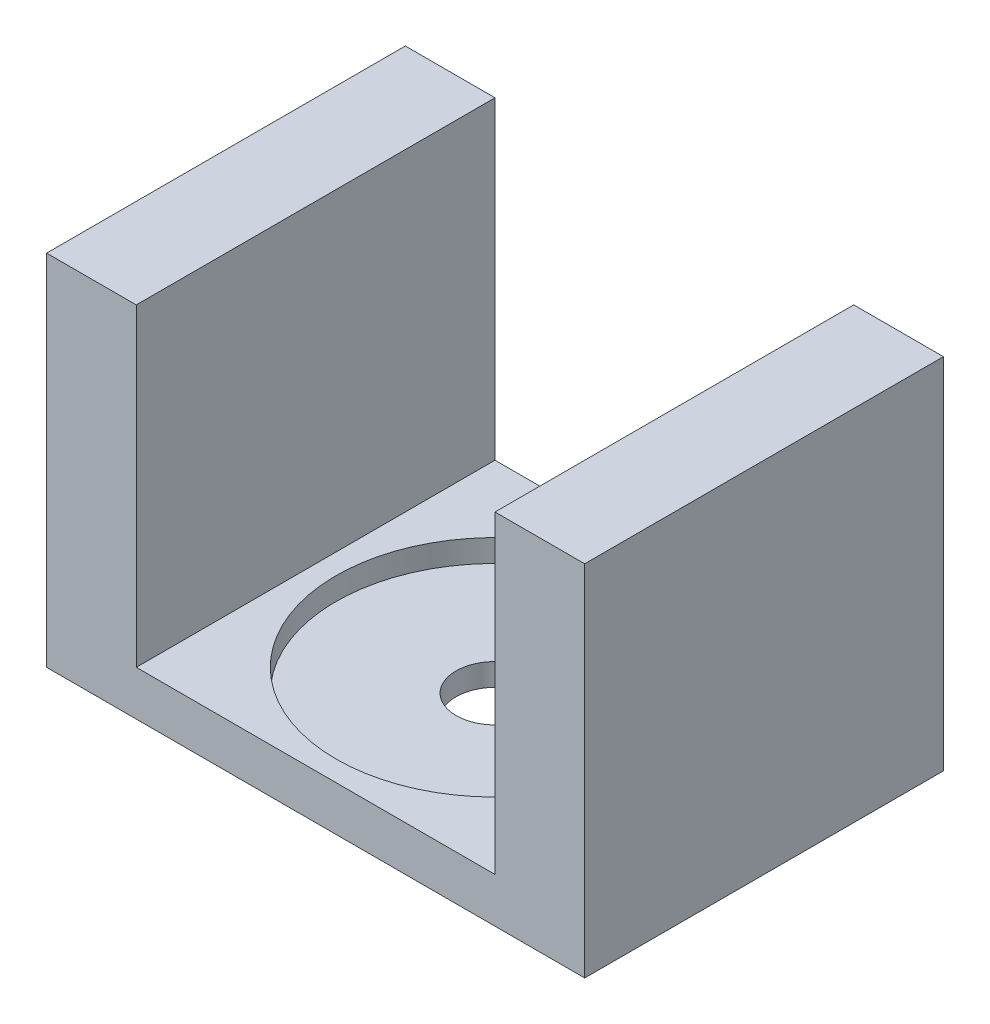
ISO-10303-21;
HEADER;
FILE_DESCRIPTION(('STEP AP214'),'2;1');
FILE_NAME('part.step','',(''),(''),'','','');
FILE_SCHEMA(('AUTOMOTIVE_DESIGN { 1 0 10303 214 1 1 1 1 }'));
ENDSEC;
DATA;
#1=APPLICATION_CONTEXT('core data for automotive mechanical design processes');
#2=APPLICATION_PROTOCOL_DEFINITION('international standard','automotive_design',2000,#1);
#3=PRODUCT_CONTEXT('',#1,'mechanical');
#4=PRODUCT('Part','Part','',(#3));
#5=PRODUCT_RELATED_PRODUCT_CATEGORY('part','',(#4));
#6=PRODUCT_DEFINITION_FORMATION('','',#4);
#7=PRODUCT_DEFINITION_CONTEXT('part definition',#1,'design');
#8=PRODUCT_DEFINITION('design','',#6,#7);
#9=PRODUCT_DEFINITION_SHAPE('','',#8);
#10=(LENGTH_UNIT() NAMED_UNIT(*) SI_UNIT(.MILLI.,.METRE.));
#11=(NAMED_UNIT(*) PLANE_ANGLE_UNIT() SI_UNIT($,.RADIAN.));
#12=(NAMED_UNIT(*) SI_UNIT($,.STERADIAN.) SOLID_ANGLE_UNIT());
#13=UNCERTAINTY_MEASURE_WITH_UNIT(LENGTH_MEASURE(1.E-05),#10,'distance_accuracy_value','');
#14=(GEOMETRIC_REPRESENTATION_CONTEXT(3) GLOBAL_UNCERTAINTY_ASSIGNED_CONTEXT((#13)) GLOBAL_UNIT_ASSIGNED_CONTEXT((#10,
#11,#12)) REPRESENTATION_CONTEXT('',''));
#15=CARTESIAN_POINT('',(0.,0.,0.));
#16=DIRECTION('',(0.,0.,1.));
#17=DIRECTION('',(1.,0.,0.));
#18=AXIS2_PLACEMENT_3D('',#15,#16,#17);
#19=CARTESIAN_POINT('',(-25.4,6.34999999999997,50.8));
#20=DIRECTION('',(-1.,0.,0.));
#21=DIRECTION('',(0.,-1.,0.));
#22=AXIS2_PLACEMENT_3D('',#19,#20,#21);
#23=PLANE('',#22);
#24=DIRECTION('',(0.,1.,0.));
#25=VECTOR('',#24,1.);
#26=CARTESIAN_POINT('',(-25.4,6.34999999999997,0.));
#27=LINE('',#26,#25);
#28=CARTESIAN_POINT('',(-25.4,6.34999999999997,0.));
#29=VERTEX_POINT('',#28);
#30=CARTESIAN_POINT('',(-25.4,50.8,0.));
#31=VERTEX_POINT('',#30);
#32=EDGE_CURVE('E128',#29,#31,#27,.T.);
#33=ORIENTED_EDGE('',*,*,#32,.T.);
#34=DIRECTION('',(0.,0.,-1.));
#35=VECTOR('',#34,1.);
#36=CARTESIAN_POINT('',(-25.4,50.8,50.8));
#37=LINE('',#36,#35);
#38=CARTESIAN_POINT('',(-25.4,50.8,50.8));
#39=VERTEX_POINT('',#38);
#40=EDGE_CURVE('E11',#39,#31,#37,.T.);
#41=ORIENTED_EDGE('',*,*,#40,.F.);
#42=DIRECTION('',(0.,1.,0.));
#43=VECTOR('',#42,1.);
#44=CARTESIAN_POINT('',(-25.4,6.34999999999997,50.8));
#45=LINE('',#44,#43);
#46=CARTESIAN_POINT('',(-25.4,6.34999999999997,50.8));
#47=VERTEX_POINT('',#46);
#48=EDGE_CURVE('E143',#47,#39,#45,.T.);
#49=ORIENTED_EDGE('',*,*,#48,.F.);
#50=DIRECTION('',(0.,0.,-1.));
#51=VECTOR('',#50,1.);
#52=CARTESIAN_POINT('',(-25.4,6.34999999999997,50.8));
#53=LINE('',#52,#51);
#54=EDGE_CURVE('E124',#47,#29,#53,.T.);
#55=ORIENTED_EDGE('',*,*,#54,.T.);
#56=EDGE_LOOP('',(#33,#41,#49,#55));
#57=FACE_BOUND('',#56,.T.);
#58=ADVANCED_FACE('F32',(#57),#23,.F.);
#59=CARTESIAN_POINT('',(-25.4,50.8,50.8));
#60=DIRECTION('',(0.,-1.,0.));
#61=DIRECTION('',(0.,0.,-1.));
#62=AXIS2_PLACEMENT_3D('',#59,#60,#61);
#63=PLANE('',#62);
#64=DIRECTION('',(-1.,0.,0.));
#65=VECTOR('',#64,1.);
#66=CARTESIAN_POINT('',(-25.4,50.8,0.));
#67=LINE('',#66,#65);
#68=CARTESIAN_POINT('',(-38.1,50.8,0.));
#69=VERTEX_POINT('',#68);
#70=EDGE_CURVE('E131',#31,#69,#67,.T.);
#71=ORIENTED_EDGE('',*,*,#70,.T.);
#72=DIRECTION('',(0.,0.,-1.));
#73=VECTOR('',#72,1.);
#74=CARTESIAN_POINT('',(-38.1,50.8,50.8));
#75=LINE('',#74,#73);
#76=CARTESIAN_POINT('',(-38.1,50.8,50.8));
#77=VERTEX_POINT('',#76);
#78=EDGE_CURVE('E40',#77,#69,#75,.T.);
#79=ORIENTED_EDGE('',*,*,#78,.F.);
#80=DIRECTION('',(-1.,0.,0.));
#81=VECTOR('',#80,1.);
#82=CARTESIAN_POINT('',(-25.4,50.8,50.8));
#83=LINE('',#82,#81);
#84=EDGE_CURVE('E91',#39,#77,#83,.T.);
#85=ORIENTED_EDGE('',*,*,#84,.F.);
#86=ORIENTED_EDGE('',*,*,#40,.T.);
#87=EDGE_LOOP('',(#71,#79,#85,#86));
#88=FACE_BOUND('',#87,.T.);
#89=ADVANCED_FACE('F218',(#88),#63,.F.);
#90=CARTESIAN_POINT('',(-38.1,0.,50.8));
#91=DIRECTION('',(1.,0.,0.));
#92=DIRECTION('',(0.,0.,-1.));
#93=AXIS2_PLACEMENT_3D('',#90,#91,#92);
#94=PLANE('',#93);
#95=DIRECTION('',(0.,-1.,0.));
#96=VECTOR('',#95,1.);
#97=CARTESIAN_POINT('',(-38.1,0.,0.));
#98=LINE('',#97,#96);
#99=CARTESIAN_POINT('',(-38.1,0.,0.));
#100=VERTEX_POINT('',#99);
#101=EDGE_CURVE('E134',#69,#100,#98,.T.);
#102=ORIENTED_EDGE('',*,*,#101,.T.);
#103=DIRECTION('',(0.,0.,-1.));
#104=VECTOR('',#103,1.);
#105=CARTESIAN_POINT('',(-38.1,0.,50.8));
#106=LINE('',#105,#104);
#107=CARTESIAN_POINT('',(-38.1,0.,50.8));
#108=VERTEX_POINT('',#107);
#109=EDGE_CURVE('E150',#108,#100,#106,.T.);
#110=ORIENTED_EDGE('',*,*,#109,.F.);
#111=DIRECTION('',(0.,-1.,0.));
#112=VECTOR('',#111,1.);
#113=CARTESIAN_POINT('',(-38.1,0.,50.8));
#114=LINE('',#113,#112);
#115=EDGE_CURVE('E158',#77,#108,#114,.T.);
#116=ORIENTED_EDGE('',*,*,#115,.F.);
#117=ORIENTED_EDGE('',*,*,#78,.T.);
#118=EDGE_LOOP('',(#102,#110,#116,#117));
#119=FACE_BOUND('',#118,.T.);
#120=ADVANCED_FACE('F156',(#119),#94,.F.);
#121=CARTESIAN_POINT('',(38.1,0.,50.8));
#122=DIRECTION('',(0.,1.,0.));
#123=DIRECTION('',(0.,0.,1.));
#124=AXIS2_PLACEMENT_3D('',#121,#122,#123);
#125=PLANE('',#124);
#126=CARTESIAN_POINT('',(0.,0.,25.4));
#127=DIRECTION('',(0.,1.,0.));
#128=DIRECTION('',(0.,0.,1.));
#129=AXIS2_PLACEMENT_3D('',#126,#127,#128);
#130=CIRCLE('',#129,5.5);
#131=CARTESIAN_POINT('',(0.,0.,30.9));
#132=VERTEX_POINT('',#131);
#133=EDGE_CURVE('E179',#132,#132,#130,.T.);
#134=ORIENTED_EDGE('',*,*,#133,.T.);
#135=EDGE_LOOP('',(#134));
#136=FACE_BOUND('',#135,.T.);
#137=DIRECTION('',(1.,0.,0.));
#138=VECTOR('',#137,1.);
#139=CARTESIAN_POINT('',(38.1,0.,0.));
#140=LINE('',#139,#138);
#141=CARTESIAN_POINT('',(38.1,0.,0.));
#142=VERTEX_POINT('',#141);
#143=EDGE_CURVE('E136',#100,#142,#140,.T.);
#144=ORIENTED_EDGE('',*,*,#143,.T.);
#145=DIRECTION('',(0.,0.,-1.));
#146=VECTOR('',#145,1.);
#147=CARTESIAN_POINT('',(38.1,0.,50.8));
#148=LINE('',#147,#146);
#149=CARTESIAN_POINT('',(38.1,0.,50.8));
#150=VERTEX_POINT('',#149);
#151=EDGE_CURVE('E147',#150,#142,#148,.T.);
#152=ORIENTED_EDGE('',*,*,#151,.F.);
#153=DIRECTION('',(1.,0.,0.));
#154=VECTOR('',#153,1.);
#155=CARTESIAN_POINT('',(38.1,0.,50.8));
#156=LINE('',#155,#154);
#157=EDGE_CURVE('E170',#108,#150,#156,.T.);
#158=ORIENTED_EDGE('',*,*,#157,.F.);
#159=ORIENTED_EDGE('',*,*,#109,.T.);
#160=EDGE_LOOP('',(#144,#152,#158,#159));
#161=FACE_BOUND('',#160,.T.);
#162=ADVANCED_FACE('F166',(#136,#161),#125,.F.);
#163=CARTESIAN_POINT('',(38.1,0.,50.8));
#164=DIRECTION('',(-1.,0.,0.));
#165=DIRECTION('',(0.,0.,1.));
#166=AXIS2_PLACEMENT_3D('',#163,#164,#165);
#167=PLANE('',#166);
#168=DIRECTION('',(0.,1.,0.));
#169=VECTOR('',#168,1.);
#170=CARTESIAN_POINT('',(38.1,0.,0.));
#171=LINE('',#170,#169);
#172=CARTESIAN_POINT('',(38.1,50.8,0.));
#173=VERTEX_POINT('',#172);
#174=EDGE_CURVE('E138',#142,#173,#171,.T.);
#175=ORIENTED_EDGE('',*,*,#174,.T.);
#176=DIRECTION('',(0.,0.,-1.));
#177=VECTOR('',#176,1.);
#178=CARTESIAN_POINT('',(38.1,50.8,50.8));
#179=LINE('',#178,#177);
#180=CARTESIAN_POINT('',(38.1,50.8,50.8));
#181=VERTEX_POINT('',#180);
#182=EDGE_CURVE('E119',#181,#173,#179,.T.);
#183=ORIENTED_EDGE('',*,*,#182,.F.);
#184=DIRECTION('',(0.,1.,0.));
#185=VECTOR('',#184,1.);
#186=CARTESIAN_POINT('',(38.1,0.,50.8));
#187=LINE('',#186,#185);
#188=EDGE_CURVE('E110',#150,#181,#187,.T.);
#189=ORIENTED_EDGE('',*,*,#188,.F.);
#190=ORIENTED_EDGE('',*,*,#151,.T.);
#191=EDGE_LOOP('',(#175,#183,#189,#190));
#192=FACE_BOUND('',#191,.T.);
#193=ADVANCED_FACE('F169',(#192),#167,.F.);
#194=CARTESIAN_POINT('',(25.4,50.8,50.8));
#195=DIRECTION('',(0.,-1.,0.));
#196=DIRECTION('',(0.,0.,-1.));
#197=AXIS2_PLACEMENT_3D('',#194,#195,#196);
#198=PLANE('',#197);
#199=DIRECTION('',(-1.,0.,0.));
#200=VECTOR('',#199,1.);
#201=CARTESIAN_POINT('',(25.4,50.8,0.));
#202=LINE('',#201,#200);
#203=CARTESIAN_POINT('',(25.4,50.8,0.));
#204=VERTEX_POINT('',#203);
#205=EDGE_CURVE('E118',#173,#204,#202,.T.);
#206=ORIENTED_EDGE('',*,*,#205,.T.);
#207=DIRECTION('',(0.,0.,-1.));
#208=VECTOR('',#207,1.);
#209=CARTESIAN_POINT('',(25.4,50.8,50.8));
#210=LINE('',#209,#208);
#211=CARTESIAN_POINT('',(25.4,50.8,50.8));
#212=VERTEX_POINT('',#211);
#213=EDGE_CURVE('E115',#212,#204,#210,.T.);
#214=ORIENTED_EDGE('',*,*,#213,.F.);
#215=DIRECTION('',(-1.,0.,0.));
#216=VECTOR('',#215,1.);
#217=CARTESIAN_POINT('',(25.4,50.8,50.8));
#218=LINE('',#217,#216);
#219=EDGE_CURVE('E104',#181,#212,#218,.T.);
#220=ORIENTED_EDGE('',*,*,#219,.F.);
#221=ORIENTED_EDGE('',*,*,#182,.T.);
#222=EDGE_LOOP('',(#206,#214,#220,#221));
#223=FACE_BOUND('',#222,.T.);
#224=ADVANCED_FACE('F116',(#223),#198,.F.);
#225=CARTESIAN_POINT('',(25.4,6.34999999999997,50.8));
#226=DIRECTION('',(1.,0.,0.));
#227=DIRECTION('',(0.,1.,0.));
#228=AXIS2_PLACEMENT_3D('',#225,#226,#227);
#229=PLANE('',#228);
#230=DIRECTION('',(0.,-1.,0.));
#231=VECTOR('',#230,1.);
#232=CARTESIAN_POINT('',(25.4,6.34999999999997,0.));
#233=LINE('',#232,#231);
#234=CARTESIAN_POINT('',(25.4,6.34999999999997,0.));
#235=VERTEX_POINT('',#234);
#236=EDGE_CURVE('E77',#204,#235,#233,.T.);
#237=ORIENTED_EDGE('',*,*,#236,.T.);
#238=DIRECTION('',(0.,0.,-1.));
#239=VECTOR('',#238,1.);
#240=CARTESIAN_POINT('',(25.4,6.34999999999997,50.8));
#241=LINE('',#240,#239);
#242=CARTESIAN_POINT('',(25.4,6.34999999999997,50.8));
#243=VERTEX_POINT('',#242);
#244=EDGE_CURVE('E120',#243,#235,#241,.T.);
#245=ORIENTED_EDGE('',*,*,#244,.F.);
#246=DIRECTION('',(0.,-1.,0.));
#247=VECTOR('',#246,1.);
#248=CARTESIAN_POINT('',(25.4,6.34999999999997,50.8));
#249=LINE('',#248,#247);
#250=EDGE_CURVE('E108',#212,#243,#249,.T.);
#251=ORIENTED_EDGE('',*,*,#250,.F.);
#252=ORIENTED_EDGE('',*,*,#213,.T.);
#253=EDGE_LOOP('',(#237,#245,#251,#252));
#254=FACE_BOUND('',#253,.T.);
#255=ADVANCED_FACE('F122',(#254),#229,.F.);
#256=CARTESIAN_POINT('',(25.4,6.34999999999997,50.8));
#257=DIRECTION('',(0.,-1.,0.));
#258=DIRECTION('',(0.,0.,-1.));
#259=AXIS2_PLACEMENT_3D('',#256,#257,#258);
#260=PLANE('',#259);
#261=CARTESIAN_POINT('',(0.,6.34999999999997,25.4));
#262=DIRECTION('',(0.,1.,0.));
#263=DIRECTION('',(0.,0.,1.));
#264=AXIS2_PLACEMENT_3D('',#261,#262,#263);
#265=CIRCLE('',#264,22.5044);
#266=CARTESIAN_POINT('',(0.,6.34999999999997,47.9044));
#267=VERTEX_POINT('',#266);
#268=EDGE_CURVE('E176',#267,#267,#265,.T.);
#269=ORIENTED_EDGE('',*,*,#268,.F.);
#270=EDGE_LOOP('',(#269));
#271=FACE_BOUND('',#270,.T.);
#272=DIRECTION('',(-1.,0.,0.));
#273=VECTOR('',#272,1.);
#274=CARTESIAN_POINT('',(25.4,6.34999999999997,0.));
#275=LINE('',#274,#273);
#276=EDGE_CURVE('E83',#235,#29,#275,.T.);
#277=ORIENTED_EDGE('',*,*,#276,.T.);
#278=ORIENTED_EDGE('',*,*,#54,.F.);
#279=DIRECTION('',(-1.,0.,0.));
#280=VECTOR('',#279,1.);
#281=CARTESIAN_POINT('',(25.4,6.34999999999997,50.8));
#282=LINE('',#281,#280);
#283=EDGE_CURVE('E48',#243,#47,#282,.T.);
#284=ORIENTED_EDGE('',*,*,#283,.F.);
#285=ORIENTED_EDGE('',*,*,#244,.T.);
#286=EDGE_LOOP('',(#277,#278,#284,#285));
#287=FACE_BOUND('',#286,.T.);
#288=ADVANCED_FACE('F207',(#271,#287),#260,.F.);
#289=CARTESIAN_POINT('',(0.,0.,50.8));
#290=DIRECTION('',(0.,0.,1.));
#291=DIRECTION('',(1.,0.,0.));
#292=AXIS2_PLACEMENT_3D('',#289,#290,#291);
#293=PLANE('',#292);
#294=ORIENTED_EDGE('',*,*,#48,.T.);
#295=ORIENTED_EDGE('',*,*,#84,.T.);
#296=ORIENTED_EDGE('',*,*,#115,.T.);
#297=ORIENTED_EDGE('',*,*,#157,.T.);
#298=ORIENTED_EDGE('',*,*,#188,.T.);
#299=ORIENTED_EDGE('',*,*,#219,.T.);
#300=ORIENTED_EDGE('',*,*,#250,.T.);
#301=ORIENTED_EDGE('',*,*,#283,.T.);
#302=EDGE_LOOP('',(#294,#295,#296,#297,#298,#299,#300,#301));
#303=FACE_BOUND('',#302,.T.);
#304=ADVANCED_FACE('F106',(#303),#293,.T.);
#305=CARTESIAN_POINT('',(0.,0.,0.));
#306=DIRECTION('',(0.,0.,1.));
#307=DIRECTION('',(1.,0.,0.));
#308=AXIS2_PLACEMENT_3D('',#305,#306,#307);
#309=PLANE('',#308);
#310=ORIENTED_EDGE('',*,*,#32,.F.);
#311=ORIENTED_EDGE('',*,*,#276,.F.);
#312=ORIENTED_EDGE('',*,*,#236,.F.);
#313=ORIENTED_EDGE('',*,*,#205,.F.);
#314=ORIENTED_EDGE('',*,*,#174,.F.);
#315=ORIENTED_EDGE('',*,*,#143,.F.);
#316=ORIENTED_EDGE('',*,*,#101,.F.);
#317=ORIENTED_EDGE('',*,*,#70,.F.);
#318=EDGE_LOOP('',(#310,#311,#312,#313,#314,#315,#316,#317));
#319=FACE_BOUND('',#318,.T.);
#320=ADVANCED_FACE('F162',(#319),#309,.F.);
#321=CARTESIAN_POINT('',(0.,3.17499999999997,25.4));
#322=DIRECTION('',(0.,1.,0.));
#323=DIRECTION('',(0.,0.,1.));
#324=AXIS2_PLACEMENT_3D('',#321,#322,#323);
#325=CYLINDRICAL_SURFACE('',#324,22.5044);
#326=CARTESIAN_POINT('',(0.,3.17499999999997,25.4));
#327=DIRECTION('',(0.,1.,0.));
#328=DIRECTION('',(0.,0.,1.));
#329=AXIS2_PLACEMENT_3D('',#326,#327,#328);
#330=CIRCLE('',#329,22.5044);
#331=CARTESIAN_POINT('',(0.,3.17499999999997,47.9044));
#332=VERTEX_POINT('',#331);
#333=EDGE_CURVE('E132',#332,#332,#330,.T.);
#334=ORIENTED_EDGE('',*,*,#333,.F.);
#335=EDGE_LOOP('',(#334));
#336=FACE_BOUND('',#335,.T.);
#337=ORIENTED_EDGE('',*,*,#268,.T.);
#338=EDGE_LOOP('',(#337));
#339=FACE_BOUND('',#338,.T.);
#340=ADVANCED_FACE('F198',(#336,#339),#325,.F.);
#341=CARTESIAN_POINT('',(0.,3.17499999999997,25.4));
#342=DIRECTION('',(0.,1.,0.));
#343=DIRECTION('',(0.,0.,1.));
#344=AXIS2_PLACEMENT_3D('',#341,#342,#343);
#345=PLANE('',#344);
#346=CARTESIAN_POINT('',(0.,3.17499999999997,25.4));
#347=DIRECTION('',(0.,1.,0.));
#348=DIRECTION('',(0.,0.,1.));
#349=AXIS2_PLACEMENT_3D('',#346,#347,#348);
#350=CIRCLE('',#349,5.5);
#351=CARTESIAN_POINT('',(0.,3.17499999999997,30.9));
#352=VERTEX_POINT('',#351);
#353=EDGE_CURVE('E182',#352,#352,#350,.T.);
#354=ORIENTED_EDGE('',*,*,#353,.F.);
#355=EDGE_LOOP('',(#354));
#356=FACE_BOUND('',#355,.T.);
#357=ORIENTED_EDGE('',*,*,#333,.T.);
#358=EDGE_LOOP('',(#357));
#359=FACE_BOUND('',#358,.T.);
#360=ADVANCED_FACE('F192',(#356,#359),#345,.T.);
#361=CARTESIAN_POINT('',(0.,0.,25.4));
#362=DIRECTION('',(0.,1.,0.));
#363=DIRECTION('',(0.,0.,1.));
#364=AXIS2_PLACEMENT_3D('',#361,#362,#363);
#365=CYLINDRICAL_SURFACE('',#364,5.5);
#366=ORIENTED_EDGE('',*,*,#133,.F.);
#367=EDGE_LOOP('',(#366));
#368=FACE_BOUND('',#367,.T.);
#369=ORIENTED_EDGE('',*,*,#353,.T.);
#370=EDGE_LOOP('',(#369));
#371=FACE_BOUND('',#370,.T.);
#372=ADVANCED_FACE('F189',(#368,#371),#365,.F.);
#373=CLOSED_SHELL('',(#58,#89,#120,#162,#193,#224,#255,#288,#304,#320,#340,#360,#372));
#374=MANIFOLD_SOLID_BREP('B2',#373);
#375=ADVANCED_BREP_SHAPE_REPRESENTATION('',(#18,#374),#14);
#376=SHAPE_DEFINITION_REPRESENTATION(#9,#375);
ENDSEC;
END-ISO-10303-21;
